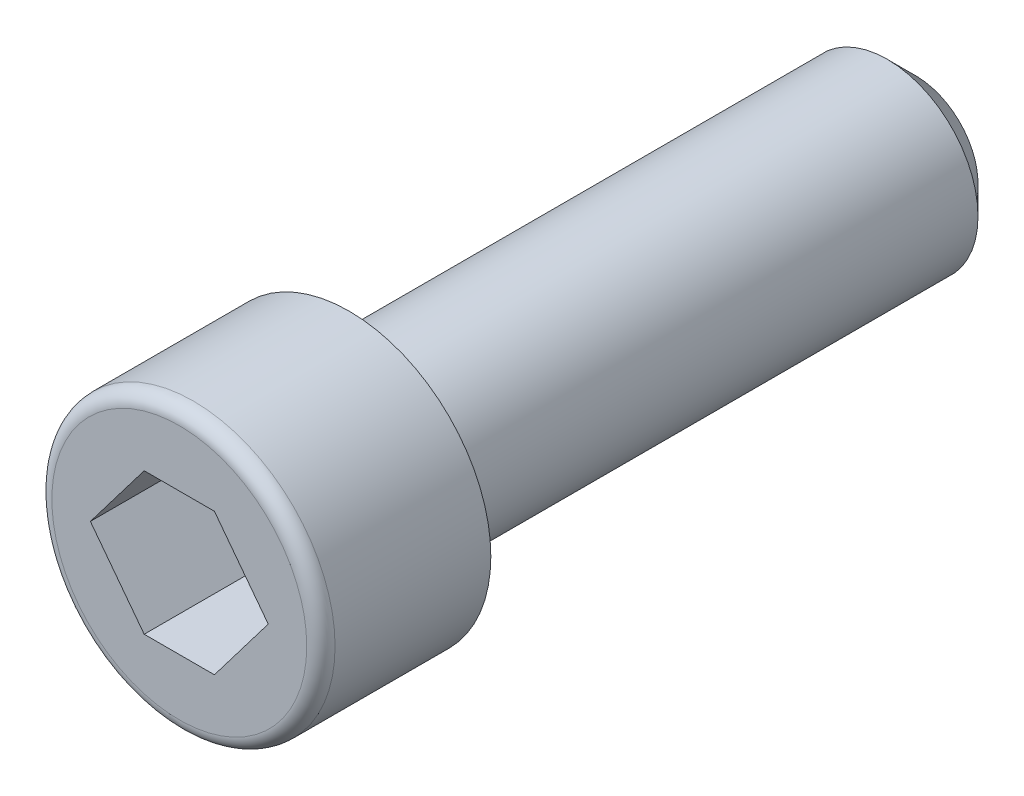
ISO-10303-21;
HEADER;
FILE_DESCRIPTION(('STEP AP214'),'2;1');
FILE_NAME('part.step','',(''),(''),'','','');
FILE_SCHEMA(('AUTOMOTIVE_DESIGN { 1 0 10303 214 1 1 1 1 }'));
ENDSEC;
DATA;
#1=APPLICATION_CONTEXT('core data for automotive mechanical design processes');
#2=APPLICATION_PROTOCOL_DEFINITION('international standard','automotive_design',2000,#1);
#3=PRODUCT_CONTEXT('',#1,'mechanical');
#4=PRODUCT('Part','Part','',(#3));
#5=PRODUCT_RELATED_PRODUCT_CATEGORY('part','',(#4));
#6=PRODUCT_DEFINITION_FORMATION('','',#4);
#7=PRODUCT_DEFINITION_CONTEXT('part definition',#1,'design');
#8=PRODUCT_DEFINITION('design','',#6,#7);
#9=PRODUCT_DEFINITION_SHAPE('','',#8);
#10=(LENGTH_UNIT() NAMED_UNIT(*) SI_UNIT(.MILLI.,.METRE.));
#11=(NAMED_UNIT(*) PLANE_ANGLE_UNIT() SI_UNIT($,.RADIAN.));
#12=(NAMED_UNIT(*) SI_UNIT($,.STERADIAN.) SOLID_ANGLE_UNIT());
#13=UNCERTAINTY_MEASURE_WITH_UNIT(LENGTH_MEASURE(1.E-05),#10,'distance_accuracy_value','');
#14=(GEOMETRIC_REPRESENTATION_CONTEXT(3) GLOBAL_UNCERTAINTY_ASSIGNED_CONTEXT((#13)) GLOBAL_UNIT_ASSIGNED_CONTEXT((#10,
#11,#12)) REPRESENTATION_CONTEXT('',''));
#15=CARTESIAN_POINT('',(0.,0.,0.));
#16=DIRECTION('',(0.,0.,1.));
#17=DIRECTION('',(1.,0.,0.));
#18=AXIS2_PLACEMENT_3D('',#15,#16,#17);
#19=CARTESIAN_POINT('',(0.,0.,0.));
#20=DIRECTION('',(0.,0.,1.));
#21=DIRECTION('',(1.,0.,0.));
#22=AXIS2_PLACEMENT_3D('',#19,#20,#21);
#23=PLANE('',#22);
#24=CARTESIAN_POINT('',(0.,0.,0.));
#25=DIRECTION('',(0.,0.,1.));
#26=DIRECTION('',(1.,0.,0.));
#27=AXIS2_PLACEMENT_3D('',#24,#25,#26);
#28=CIRCLE('',#27,5.);
#29=CARTESIAN_POINT('',(5.00000000000001,0.,0.));
#30=VERTEX_POINT('',#29);
#31=EDGE_CURVE('E140',#30,#30,#28,.T.);
#32=ORIENTED_EDGE('',*,*,#31,.F.);
#33=EDGE_LOOP('',(#32));
#34=FACE_BOUND('',#33,.T.);
#35=CARTESIAN_POINT('',(0.,0.,0.));
#36=DIRECTION('',(0.,0.,-1.));
#37=DIRECTION('',(-1.,0.,0.));
#38=AXIS2_PLACEMENT_3D('',#35,#36,#37);
#39=CIRCLE('',#38,3.20158040294037);
#40=CARTESIAN_POINT('',(-3.20158040294038,0.,0.));
#41=VERTEX_POINT('',#40);
#42=EDGE_CURVE('E141',#41,#41,#39,.T.);
#43=ORIENTED_EDGE('',*,*,#42,.F.);
#44=EDGE_LOOP('',(#43));
#45=FACE_BOUND('',#44,.T.);
#46=ADVANCED_FACE('F32',(#34,#45),#23,.F.);
#47=CARTESIAN_POINT('',(0.,0.,6.));
#48=DIRECTION('',(0.,0.,-1.));
#49=DIRECTION('',(-1.,0.,0.));
#50=AXIS2_PLACEMENT_3D('',#47,#48,#49);
#51=CYLINDRICAL_SURFACE('',#50,5.);
#52=CARTESIAN_POINT('',(0.,0.,5.5));
#53=DIRECTION('',(0.,0.,1.));
#54=DIRECTION('',(1.,0.,0.));
#55=AXIS2_PLACEMENT_3D('',#52,#53,#54);
#56=CIRCLE('',#55,5.);
#57=CARTESIAN_POINT('',(5.00000000000001,0.,5.5));
#58=VERTEX_POINT('',#57);
#59=EDGE_CURVE('E149',#58,#58,#56,.F.);
#60=ORIENTED_EDGE('',*,*,#59,.T.);
#61=EDGE_LOOP('',(#60));
#62=FACE_BOUND('',#61,.T.);
#63=ORIENTED_EDGE('',*,*,#31,.T.);
#64=EDGE_LOOP('',(#63));
#65=FACE_BOUND('',#64,.T.);
#66=ADVANCED_FACE('F34',(#62,#65),#51,.T.);
#67=CARTESIAN_POINT('',(0.,0.,6.));
#68=DIRECTION('',(0.,0.,1.));
#69=DIRECTION('',(1.,0.,0.));
#70=AXIS2_PLACEMENT_3D('',#67,#68,#69);
#71=PLANE('',#70);
#72=CARTESIAN_POINT('',(0.,0.,6.));
#73=DIRECTION('',(0.,0.,1.));
#74=DIRECTION('',(1.,0.,0.));
#75=AXIS2_PLACEMENT_3D('',#72,#73,#74);
#76=CIRCLE('',#75,4.5);
#77=CARTESIAN_POINT('',(4.50000000000001,0.,6.));
#78=VERTEX_POINT('',#77);
#79=EDGE_CURVE('E144',#78,#78,#76,.T.);
#80=ORIENTED_EDGE('',*,*,#79,.T.);
#81=EDGE_LOOP('',(#80));
#82=FACE_BOUND('',#81,.T.);
#83=DIRECTION('',(0.605083267533575,0.796162194123093,0.));
#84=VECTOR('',#83,1.);
#85=CARTESIAN_POINT('',(1.24006369362148,-2.49999999999999,6.));
#86=LINE('',#85,#84);
#87=CARTESIAN_POINT('',(1.24006369362148,-2.49999999999999,6.));
#88=VERTEX_POINT('',#87);
#89=CARTESIAN_POINT('',(3.14006369362154,0.,6.));
#90=VERTEX_POINT('',#89);
#91=EDGE_CURVE('E47',#88,#90,#86,.T.);
#92=ORIENTED_EDGE('',*,*,#91,.F.);
#93=DIRECTION('',(1.,0.,0.));
#94=VECTOR('',#93,1.);
#95=CARTESIAN_POINT('',(-1.24006369362148,-2.5,6.));
#96=LINE('',#95,#94);
#97=CARTESIAN_POINT('',(-1.24006369362148,-2.5,6.));
#98=VERTEX_POINT('',#97);
#99=EDGE_CURVE('E116',#98,#88,#96,.T.);
#100=ORIENTED_EDGE('',*,*,#99,.F.);
#101=DIRECTION('',(0.605083267533577,-0.796162194123093,0.));
#102=VECTOR('',#101,1.);
#103=CARTESIAN_POINT('',(-3.14006369362158,0.,6.));
#104=LINE('',#103,#102);
#105=CARTESIAN_POINT('',(-3.14006369362158,0.,6.));
#106=VERTEX_POINT('',#105);
#107=EDGE_CURVE('E110',#106,#98,#104,.T.);
#108=ORIENTED_EDGE('',*,*,#107,.F.);
#109=DIRECTION('',(-0.605083267533575,-0.796162194123093,0.));
#110=VECTOR('',#109,1.);
#111=CARTESIAN_POINT('',(-1.24006369362148,2.5,6.));
#112=LINE('',#111,#110);
#113=CARTESIAN_POINT('',(-1.24006369362148,2.5,6.));
#114=VERTEX_POINT('',#113);
#115=EDGE_CURVE('E108',#114,#106,#112,.T.);
#116=ORIENTED_EDGE('',*,*,#115,.F.);
#117=DIRECTION('',(-1.,0.,0.));
#118=VECTOR('',#117,1.);
#119=CARTESIAN_POINT('',(1.24006369362148,2.5,6.));
#120=LINE('',#119,#118);
#121=CARTESIAN_POINT('',(1.24006369362148,2.5,6.));
#122=VERTEX_POINT('',#121);
#123=EDGE_CURVE('E90',#122,#114,#120,.T.);
#124=ORIENTED_EDGE('',*,*,#123,.F.);
#125=DIRECTION('',(-0.605083267533577,0.796162194123093,0.));
#126=VECTOR('',#125,1.);
#127=CARTESIAN_POINT('',(3.14006369362154,0.,6.));
#128=LINE('',#127,#126);
#129=EDGE_CURVE('E101',#90,#122,#128,.T.);
#130=ORIENTED_EDGE('',*,*,#129,.F.);
#131=EDGE_LOOP('',(#92,#100,#108,#116,#124,#130));
#132=FACE_BOUND('',#131,.T.);
#133=ADVANCED_FACE('F105',(#82,#132),#71,.T.);
#134=CARTESIAN_POINT('',(0.,0.,-20.));
#135=DIRECTION('',(0.,0.,1.));
#136=DIRECTION('',(1.,0.,0.));
#137=AXIS2_PLACEMENT_3D('',#134,#135,#136);
#138=CYLINDRICAL_SURFACE('',#137,3.20158040294037);
#139=CARTESIAN_POINT('',(0.,0.,-19.));
#140=DIRECTION('',(0.,0.,-1.));
#141=DIRECTION('',(-1.,0.,0.));
#142=AXIS2_PLACEMENT_3D('',#139,#140,#141);
#143=CIRCLE('',#142,3.20158040294037);
#144=CARTESIAN_POINT('',(-3.20158040294038,0.,-19.));
#145=VERTEX_POINT('',#144);
#146=EDGE_CURVE('E11',#145,#145,#143,.F.);
#147=ORIENTED_EDGE('',*,*,#146,.T.);
#148=EDGE_LOOP('',(#147));
#149=FACE_BOUND('',#148,.T.);
#150=ORIENTED_EDGE('',*,*,#42,.T.);
#151=EDGE_LOOP('',(#150));
#152=FACE_BOUND('',#151,.T.);
#153=ADVANCED_FACE('F179',(#149,#152),#138,.T.);
#154=CARTESIAN_POINT('',(0.,0.,-20.));
#155=DIRECTION('',(0.,0.,-1.));
#156=DIRECTION('',(-1.,0.,0.));
#157=AXIS2_PLACEMENT_3D('',#154,#155,#156);
#158=PLANE('',#157);
#159=CARTESIAN_POINT('',(0.,0.,-20.));
#160=DIRECTION('',(0.,0.,-1.));
#161=DIRECTION('',(-1.,0.,0.));
#162=AXIS2_PLACEMENT_3D('',#159,#160,#161);
#163=CIRCLE('',#162,2.20158040294035);
#164=CARTESIAN_POINT('',(-2.20158040294036,0.,-20.));
#165=VERTEX_POINT('',#164);
#166=EDGE_CURVE('E40',#165,#165,#163,.T.);
#167=ORIENTED_EDGE('',*,*,#166,.T.);
#168=EDGE_LOOP('',(#167));
#169=FACE_BOUND('',#168,.T.);
#170=ADVANCED_FACE('F154',(#169),#158,.T.);
#171=CARTESIAN_POINT('',(1.24006369362148,-2.49999999999999,1.));
#172=DIRECTION('',(0.796162194123093,-0.605083267533576,0.));
#173=DIRECTION('',(0.605083267533575,0.796162194123093,0.));
#174=AXIS2_PLACEMENT_3D('',#171,#172,#173);
#175=PLANE('',#174);
#176=DIRECTION('',(0.,0.,1.));
#177=VECTOR('',#176,1.);
#178=CARTESIAN_POINT('',(1.24006369362148,-2.49999999999999,1.));
#179=LINE('',#178,#177);
#180=CARTESIAN_POINT('',(1.24006369362148,-2.49999999999999,1.));
#181=VERTEX_POINT('',#180);
#182=EDGE_CURVE('E54',#181,#88,#179,.T.);
#183=ORIENTED_EDGE('',*,*,#182,.T.);
#184=ORIENTED_EDGE('',*,*,#91,.T.);
#185=DIRECTION('',(0.,0.,1.));
#186=VECTOR('',#185,1.);
#187=CARTESIAN_POINT('',(3.14006369362154,0.,1.));
#188=LINE('',#187,#186);
#189=CARTESIAN_POINT('',(3.14006369362154,0.,1.));
#190=VERTEX_POINT('',#189);
#191=EDGE_CURVE('E98',#190,#90,#188,.T.);
#192=ORIENTED_EDGE('',*,*,#191,.F.);
#193=DIRECTION('',(0.605083267533575,0.796162194123093,0.));
#194=VECTOR('',#193,1.);
#195=CARTESIAN_POINT('',(1.24006369362148,-2.49999999999999,1.));
#196=LINE('',#195,#194);
#197=EDGE_CURVE('E118',#181,#190,#196,.T.);
#198=ORIENTED_EDGE('',*,*,#197,.F.);
#199=EDGE_LOOP('',(#183,#184,#192,#198));
#200=FACE_BOUND('',#199,.T.);
#201=ADVANCED_FACE('F185',(#200),#175,.F.);
#202=CARTESIAN_POINT('',(-1.24006369362148,-2.5,1.));
#203=DIRECTION('',(0.,-1.,0.));
#204=DIRECTION('',(0.,0.,-1.));
#205=AXIS2_PLACEMENT_3D('',#202,#203,#204);
#206=PLANE('',#205);
#207=DIRECTION('',(0.,0.,1.));
#208=VECTOR('',#207,1.);
#209=CARTESIAN_POINT('',(-1.24006369362148,-2.5,1.));
#210=LINE('',#209,#208);
#211=CARTESIAN_POINT('',(-1.24006369362148,-2.5,1.));
#212=VERTEX_POINT('',#211);
#213=EDGE_CURVE('E137',#212,#98,#210,.T.);
#214=ORIENTED_EDGE('',*,*,#213,.T.);
#215=ORIENTED_EDGE('',*,*,#99,.T.);
#216=ORIENTED_EDGE('',*,*,#182,.F.);
#217=DIRECTION('',(1.,0.,0.));
#218=VECTOR('',#217,1.);
#219=CARTESIAN_POINT('',(-1.24006369362148,-2.5,1.));
#220=LINE('',#219,#218);
#221=EDGE_CURVE('E130',#212,#181,#220,.T.);
#222=ORIENTED_EDGE('',*,*,#221,.F.);
#223=EDGE_LOOP('',(#214,#215,#216,#222));
#224=FACE_BOUND('',#223,.T.);
#225=ADVANCED_FACE('F194',(#224),#206,.F.);
#226=CARTESIAN_POINT('',(-3.14006369362158,0.,1.));
#227=DIRECTION('',(-0.796162194123093,-0.605083267533577,0.));
#228=DIRECTION('',(0.605083267533577,-0.796162194123093,0.));
#229=AXIS2_PLACEMENT_3D('',#226,#227,#228);
#230=PLANE('',#229);
#231=DIRECTION('',(0.,0.,1.));
#232=VECTOR('',#231,1.);
#233=CARTESIAN_POINT('',(-3.14006369362158,0.,1.));
#234=LINE('',#233,#232);
#235=CARTESIAN_POINT('',(-3.14006369362158,0.,1.));
#236=VERTEX_POINT('',#235);
#237=EDGE_CURVE('E135',#236,#106,#234,.T.);
#238=ORIENTED_EDGE('',*,*,#237,.T.);
#239=ORIENTED_EDGE('',*,*,#107,.T.);
#240=ORIENTED_EDGE('',*,*,#213,.F.);
#241=DIRECTION('',(0.605083267533577,-0.796162194123093,0.));
#242=VECTOR('',#241,1.);
#243=CARTESIAN_POINT('',(-3.14006369362158,0.,1.));
#244=LINE('',#243,#242);
#245=EDGE_CURVE('E127',#236,#212,#244,.T.);
#246=ORIENTED_EDGE('',*,*,#245,.F.);
#247=EDGE_LOOP('',(#238,#239,#240,#246));
#248=FACE_BOUND('',#247,.T.);
#249=ADVANCED_FACE('F199',(#248),#230,.F.);
#250=CARTESIAN_POINT('',(-1.24006369362148,2.5,1.));
#251=DIRECTION('',(-0.796162194123093,0.605083267533576,0.));
#252=DIRECTION('',(-0.605083267533575,-0.796162194123093,0.));
#253=AXIS2_PLACEMENT_3D('',#250,#251,#252);
#254=PLANE('',#253);
#255=DIRECTION('',(0.,0.,1.));
#256=VECTOR('',#255,1.);
#257=CARTESIAN_POINT('',(-1.24006369362148,2.5,1.));
#258=LINE('',#257,#256);
#259=CARTESIAN_POINT('',(-1.24006369362148,2.5,1.));
#260=VERTEX_POINT('',#259);
#261=EDGE_CURVE('E97',#260,#114,#258,.T.);
#262=ORIENTED_EDGE('',*,*,#261,.T.);
#263=ORIENTED_EDGE('',*,*,#115,.T.);
#264=ORIENTED_EDGE('',*,*,#237,.F.);
#265=DIRECTION('',(-0.605083267533575,-0.796162194123093,0.));
#266=VECTOR('',#265,1.);
#267=CARTESIAN_POINT('',(-1.24006369362148,2.5,1.));
#268=LINE('',#267,#266);
#269=EDGE_CURVE('E124',#260,#236,#268,.T.);
#270=ORIENTED_EDGE('',*,*,#269,.F.);
#271=EDGE_LOOP('',(#262,#263,#264,#270));
#272=FACE_BOUND('',#271,.T.);
#273=ADVANCED_FACE('F207',(#272),#254,.F.);
#274=CARTESIAN_POINT('',(1.24006369362148,2.5,1.));
#275=DIRECTION('',(0.,1.,0.));
#276=DIRECTION('',(0.,0.,1.));
#277=AXIS2_PLACEMENT_3D('',#274,#275,#276);
#278=PLANE('',#277);
#279=DIRECTION('',(0.,0.,1.));
#280=VECTOR('',#279,1.);
#281=CARTESIAN_POINT('',(1.24006369362148,2.5,1.));
#282=LINE('',#281,#280);
#283=CARTESIAN_POINT('',(1.24006369362148,2.5,1.));
#284=VERTEX_POINT('',#283);
#285=EDGE_CURVE('E86',#284,#122,#282,.T.);
#286=ORIENTED_EDGE('',*,*,#285,.T.);
#287=ORIENTED_EDGE('',*,*,#123,.T.);
#288=ORIENTED_EDGE('',*,*,#261,.F.);
#289=DIRECTION('',(-1.,0.,0.));
#290=VECTOR('',#289,1.);
#291=CARTESIAN_POINT('',(1.24006369362148,2.5,1.));
#292=LINE('',#291,#290);
#293=EDGE_CURVE('E93',#284,#260,#292,.T.);
#294=ORIENTED_EDGE('',*,*,#293,.F.);
#295=EDGE_LOOP('',(#286,#287,#288,#294));
#296=FACE_BOUND('',#295,.T.);
#297=ADVANCED_FACE('F88',(#296),#278,.F.);
#298=CARTESIAN_POINT('',(3.14006369362154,0.,1.));
#299=DIRECTION('',(0.796162194123093,0.605083267533577,0.));
#300=DIRECTION('',(-0.605083267533577,0.796162194123093,0.));
#301=AXIS2_PLACEMENT_3D('',#298,#299,#300);
#302=PLANE('',#301);
#303=DIRECTION('',(-0.605083267533577,0.796162194123093,0.));
#304=VECTOR('',#303,1.);
#305=CARTESIAN_POINT('',(3.14006369362154,0.,1.));
#306=LINE('',#305,#304);
#307=EDGE_CURVE('E121',#190,#284,#306,.T.);
#308=ORIENTED_EDGE('',*,*,#307,.F.);
#309=ORIENTED_EDGE('',*,*,#191,.T.);
#310=ORIENTED_EDGE('',*,*,#129,.T.);
#311=ORIENTED_EDGE('',*,*,#285,.F.);
#312=EDGE_LOOP('',(#308,#309,#310,#311));
#313=FACE_BOUND('',#312,.T.);
#314=ADVANCED_FACE('F102',(#313),#302,.F.);
#315=CARTESIAN_POINT('',(3.14006369362154,0.,1.));
#316=DIRECTION('',(0.,0.,1.));
#317=DIRECTION('',(1.,0.,0.));
#318=AXIS2_PLACEMENT_3D('',#315,#316,#317);
#319=PLANE('',#318);
#320=ORIENTED_EDGE('',*,*,#197,.T.);
#321=ORIENTED_EDGE('',*,*,#307,.T.);
#322=ORIENTED_EDGE('',*,*,#293,.T.);
#323=ORIENTED_EDGE('',*,*,#269,.T.);
#324=ORIENTED_EDGE('',*,*,#245,.T.);
#325=ORIENTED_EDGE('',*,*,#221,.T.);
#326=EDGE_LOOP('',(#320,#321,#322,#323,#324,#325));
#327=FACE_BOUND('',#326,.T.);
#328=ADVANCED_FACE('F164',(#327),#319,.T.);
#329=CARTESIAN_POINT('',(0.,0.,5.5));
#330=DIRECTION('',(0.,0.,1.));
#331=DIRECTION('',(1.,0.,0.));
#332=AXIS2_PLACEMENT_3D('',#329,#330,#331);
#333=TOROIDAL_SURFACE('',#332,4.5,0.5);
#334=ORIENTED_EDGE('',*,*,#59,.F.);
#335=EDGE_LOOP('',(#334));
#336=FACE_BOUND('',#335,.T.);
#337=ORIENTED_EDGE('',*,*,#79,.F.);
#338=EDGE_LOOP('',(#337));
#339=FACE_BOUND('',#338,.T.);
#340=ADVANCED_FACE('F158',(#336,#339),#333,.T.);
#341=CARTESIAN_POINT('',(0.,0.,-20.));
#342=DIRECTION('',(0.,0.,1.));
#343=DIRECTION('',(1.,0.,0.));
#344=AXIS2_PLACEMENT_3D('',#341,#342,#343);
#345=CONICAL_SURFACE('',#344,2.20158040294035,0.785398163397453);
#346=ORIENTED_EDGE('',*,*,#146,.F.);
#347=EDGE_LOOP('',(#346));
#348=FACE_BOUND('',#347,.T.);
#349=ORIENTED_EDGE('',*,*,#166,.F.);
#350=EDGE_LOOP('',(#349));
#351=FACE_BOUND('',#350,.T.);
#352=ADVANCED_FACE('F156',(#348,#351),#345,.T.);
#353=CLOSED_SHELL('',(#46,#66,#133,#153,#170,#201,#225,#249,#273,#297,#314,#328,#340,#352));
#354=MANIFOLD_SOLID_BREP('B2',#353);
#355=ADVANCED_BREP_SHAPE_REPRESENTATION('',(#18,#354),#14);
#356=SHAPE_DEFINITION_REPRESENTATION(#9,#355);
ENDSEC;
END-ISO-10303-21;
